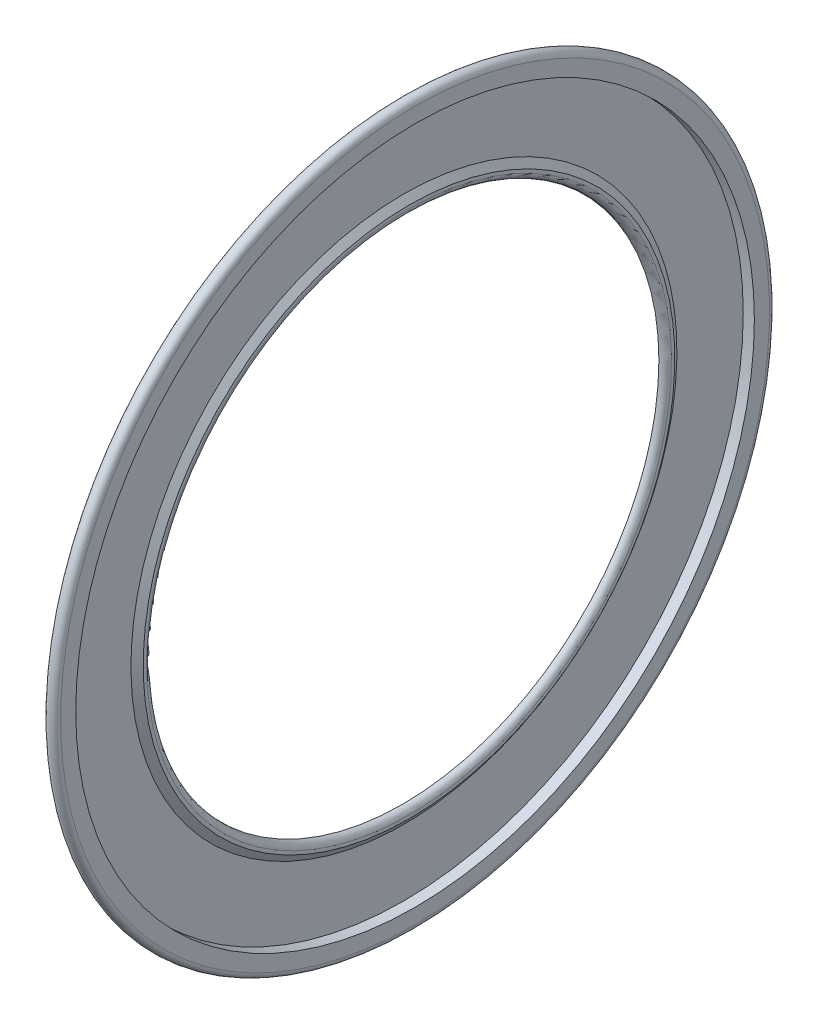
ISO-10303-21;
HEADER;
FILE_DESCRIPTION(('STEP AP214'),'2;1');
FILE_NAME('part.step','',(''),(''),'','','');
FILE_SCHEMA(('AUTOMOTIVE_DESIGN { 1 0 10303 214 1 1 1 1 }'));
ENDSEC;
DATA;
#1=APPLICATION_CONTEXT('core data for automotive mechanical design processes');
#2=APPLICATION_PROTOCOL_DEFINITION('international standard','automotive_design',2000,#1);
#3=PRODUCT_CONTEXT('',#1,'mechanical');
#4=PRODUCT('Part','Part','',(#3));
#5=PRODUCT_RELATED_PRODUCT_CATEGORY('part','',(#4));
#6=PRODUCT_DEFINITION_FORMATION('','',#4);
#7=PRODUCT_DEFINITION_CONTEXT('part definition',#1,'design');
#8=PRODUCT_DEFINITION('design','',#6,#7);
#9=PRODUCT_DEFINITION_SHAPE('','',#8);
#10=(LENGTH_UNIT() NAMED_UNIT(*) SI_UNIT(.MILLI.,.METRE.));
#11=(NAMED_UNIT(*) PLANE_ANGLE_UNIT() SI_UNIT($,.RADIAN.));
#12=(NAMED_UNIT(*) SI_UNIT($,.STERADIAN.) SOLID_ANGLE_UNIT());
#13=UNCERTAINTY_MEASURE_WITH_UNIT(LENGTH_MEASURE(1.E-05),#10,'distance_accuracy_value','');
#14=(GEOMETRIC_REPRESENTATION_CONTEXT(3) GLOBAL_UNCERTAINTY_ASSIGNED_CONTEXT((#13)) GLOBAL_UNIT_ASSIGNED_CONTEXT((#10,
#11,#12)) REPRESENTATION_CONTEXT('',''));
#15=CARTESIAN_POINT('',(0.,0.,0.));
#16=DIRECTION('',(0.,0.,1.));
#17=DIRECTION('',(1.,0.,0.));
#18=AXIS2_PLACEMENT_3D('',#15,#16,#17);
#19=CARTESIAN_POINT('',(0.245,10.600795,0.));
#20=DIRECTION('',(1.,0.,0.));
#21=DIRECTION('',(0.,1.,0.));
#22=AXIS2_PLACEMENT_3D('',#19,#20,#21);
#23=PLANE('',#22);
#24=CARTESIAN_POINT('',(0.245,0.,0.));
#25=DIRECTION('',(1.,0.,0.));
#26=DIRECTION('',(0.,1.,0.));
#27=AXIS2_PLACEMENT_3D('',#24,#25,#26);
#28=CIRCLE('',#27,11.74849);
#29=CARTESIAN_POINT('',(0.245,11.74849,0.));
#30=VERTEX_POINT('',#29);
#31=EDGE_CURVE('E11',#30,#30,#28,.T.);
#32=ORIENTED_EDGE('',*,*,#31,.T.);
#33=EDGE_LOOP('',(#32));
#34=FACE_BOUND('',#33,.T.);
#35=CARTESIAN_POINT('',(0.245,0.,0.));
#36=DIRECTION('',(1.,0.,0.));
#37=DIRECTION('',(0.,1.,0.));
#38=AXIS2_PLACEMENT_3D('',#35,#36,#37);
#39=CIRCLE('',#38,9.4531);
#40=CARTESIAN_POINT('',(0.245,9.4531,0.));
#41=VERTEX_POINT('',#40);
#42=EDGE_CURVE('E91',#41,#41,#39,.T.);
#43=ORIENTED_EDGE('',*,*,#42,.F.);
#44=EDGE_LOOP('',(#43));
#45=FACE_BOUND('',#44,.T.);
#46=ADVANCED_FACE('F16',(#34,#45),#23,.T.);
#47=CARTESIAN_POINT('',(0.4375,0.,0.));
#48=DIRECTION('',(-1.,0.,0.));
#49=DIRECTION('',(0.,1.,0.));
#50=AXIS2_PLACEMENT_3D('',#47,#48,#49);
#51=CYLINDRICAL_SURFACE('',#50,11.74849);
#52=CARTESIAN_POINT('',(0.63,0.,0.));
#53=DIRECTION('',(1.,0.,0.));
#54=DIRECTION('',(0.,1.,0.));
#55=AXIS2_PLACEMENT_3D('',#52,#53,#54);
#56=CIRCLE('',#55,11.74849);
#57=CARTESIAN_POINT('',(0.63,11.74849,0.));
#58=VERTEX_POINT('',#57);
#59=EDGE_CURVE('E26',#58,#58,#56,.T.);
#60=ORIENTED_EDGE('',*,*,#59,.T.);
#61=EDGE_LOOP('',(#60));
#62=FACE_BOUND('',#61,.T.);
#63=ORIENTED_EDGE('',*,*,#31,.F.);
#64=EDGE_LOOP('',(#63));
#65=FACE_BOUND('',#64,.T.);
#66=ADVANCED_FACE('F119',(#62,#65),#51,.F.);
#67=CARTESIAN_POINT('',(0.63,12.010245,0.));
#68=DIRECTION('',(1.,0.,0.));
#69=DIRECTION('',(0.,1.,0.));
#70=AXIS2_PLACEMENT_3D('',#67,#68,#69);
#71=PLANE('',#70);
#72=CARTESIAN_POINT('',(0.63,0.,0.));
#73=DIRECTION('',(1.,0.,0.));
#74=DIRECTION('',(0.,1.,0.));
#75=AXIS2_PLACEMENT_3D('',#72,#73,#74);
#76=CIRCLE('',#75,12.272);
#77=CARTESIAN_POINT('',(0.63,12.272,0.));
#78=VERTEX_POINT('',#77);
#79=EDGE_CURVE('E81',#78,#78,#76,.T.);
#80=ORIENTED_EDGE('',*,*,#79,.T.);
#81=EDGE_LOOP('',(#80));
#82=FACE_BOUND('',#81,.T.);
#83=ORIENTED_EDGE('',*,*,#59,.F.);
#84=EDGE_LOOP('',(#83));
#85=FACE_BOUND('',#84,.T.);
#86=ADVANCED_FACE('F82',(#82,#85),#71,.T.);
#87=CARTESIAN_POINT('',(0.42,0.,0.));
#88=DIRECTION('',(1.,0.,0.));
#89=DIRECTION('',(0.,0.,-1.));
#90=AXIS2_PLACEMENT_3D('',#87,#88,#89);
#91=TOROIDAL_SURFACE('',#90,12.272,0.21);
#92=CARTESIAN_POINT('',(0.21,0.,0.));
#93=DIRECTION('',(1.,0.,0.));
#94=DIRECTION('',(0.,1.,0.));
#95=AXIS2_PLACEMENT_3D('',#92,#93,#94);
#96=CIRCLE('',#95,12.272);
#97=CARTESIAN_POINT('',(0.21,12.272,0.));
#98=VERTEX_POINT('',#97);
#99=EDGE_CURVE('E76',#98,#98,#96,.T.);
#100=ORIENTED_EDGE('',*,*,#99,.T.);
#101=EDGE_LOOP('',(#100));
#102=FACE_BOUND('',#101,.T.);
#103=ORIENTED_EDGE('',*,*,#79,.F.);
#104=EDGE_LOOP('',(#103));
#105=FACE_BOUND('',#104,.T.);
#106=ADVANCED_FACE('F138',(#102,#105),#91,.T.);
#107=CARTESIAN_POINT('',(0.315,0.,0.));
#108=DIRECTION('',(-1.,0.,0.));
#109=DIRECTION('',(0.,1.,0.));
#110=AXIS2_PLACEMENT_3D('',#107,#108,#109);
#111=CYLINDRICAL_SURFACE('',#110,12.272);
#112=CARTESIAN_POINT('',(0.42,0.,0.));
#113=DIRECTION('',(1.,0.,0.));
#114=DIRECTION('',(0.,1.,0.));
#115=AXIS2_PLACEMENT_3D('',#112,#113,#114);
#116=CIRCLE('',#115,12.272);
#117=CARTESIAN_POINT('',(0.42,12.272,0.));
#118=VERTEX_POINT('',#117);
#119=EDGE_CURVE('E72',#118,#118,#116,.T.);
#120=ORIENTED_EDGE('',*,*,#119,.T.);
#121=EDGE_LOOP('',(#120));
#122=FACE_BOUND('',#121,.T.);
#123=ORIENTED_EDGE('',*,*,#99,.F.);
#124=EDGE_LOOP('',(#123));
#125=FACE_BOUND('',#124,.T.);
#126=ADVANCED_FACE('F18',(#122,#125),#111,.F.);
#127=CARTESIAN_POINT('',(0.42,12.19146,0.));
#128=DIRECTION('',(-1.,0.,0.));
#129=DIRECTION('',(0.,-1.,0.));
#130=AXIS2_PLACEMENT_3D('',#127,#128,#129);
#131=PLANE('',#130);
#132=CARTESIAN_POINT('',(0.42,0.,0.));
#133=DIRECTION('',(1.,0.,0.));
#134=DIRECTION('',(0.,1.,0.));
#135=AXIS2_PLACEMENT_3D('',#132,#133,#134);
#136=CIRCLE('',#135,12.11092);
#137=CARTESIAN_POINT('',(0.42,12.11092,0.));
#138=VERTEX_POINT('',#137);
#139=EDGE_CURVE('E67',#138,#138,#136,.T.);
#140=ORIENTED_EDGE('',*,*,#139,.T.);
#141=EDGE_LOOP('',(#140));
#142=FACE_BOUND('',#141,.T.);
#143=ORIENTED_EDGE('',*,*,#119,.F.);
#144=EDGE_LOOP('',(#143));
#145=FACE_BOUND('',#144,.T.);
#146=ADVANCED_FACE('F144',(#142,#145),#131,.T.);
#147=CARTESIAN_POINT('',(0.2275,0.,0.));
#148=DIRECTION('',(1.,0.,0.));
#149=DIRECTION('',(0.,1.,0.));
#150=AXIS2_PLACEMENT_3D('',#147,#148,#149);
#151=CONICAL_SURFACE('',#150,11.929705,0.755210528942879);
#152=CARTESIAN_POINT('',(0.035,0.,0.));
#153=DIRECTION('',(1.,0.,0.));
#154=DIRECTION('',(0.,1.,0.));
#155=AXIS2_PLACEMENT_3D('',#152,#153,#154);
#156=CIRCLE('',#155,11.74849);
#157=CARTESIAN_POINT('',(0.035,11.74849,0.));
#158=VERTEX_POINT('',#157);
#159=EDGE_CURVE('E20',#158,#158,#156,.T.);
#160=ORIENTED_EDGE('',*,*,#159,.T.);
#161=EDGE_LOOP('',(#160));
#162=FACE_BOUND('',#161,.T.);
#163=ORIENTED_EDGE('',*,*,#139,.F.);
#164=EDGE_LOOP('',(#163));
#165=FACE_BOUND('',#164,.T.);
#166=ADVANCED_FACE('F131',(#162,#165),#151,.T.);
#167=CARTESIAN_POINT('',(0.035,10.600795,0.));
#168=DIRECTION('',(-1.,0.,0.));
#169=DIRECTION('',(0.,-1.,0.));
#170=AXIS2_PLACEMENT_3D('',#167,#168,#169);
#171=PLANE('',#170);
#172=CARTESIAN_POINT('',(0.035,0.,0.));
#173=DIRECTION('',(1.,0.,0.));
#174=DIRECTION('',(0.,1.,0.));
#175=AXIS2_PLACEMENT_3D('',#172,#173,#174);
#176=CIRCLE('',#175,9.4531);
#177=CARTESIAN_POINT('',(0.035,9.4531,0.));
#178=VERTEX_POINT('',#177);
#179=EDGE_CURVE('E96',#178,#178,#176,.T.);
#180=ORIENTED_EDGE('',*,*,#179,.T.);
#181=EDGE_LOOP('',(#180));
#182=FACE_BOUND('',#181,.T.);
#183=ORIENTED_EDGE('',*,*,#159,.F.);
#184=EDGE_LOOP('',(#183));
#185=FACE_BOUND('',#184,.T.);
#186=ADVANCED_FACE('F127',(#182,#185),#171,.T.);
#187=CARTESIAN_POINT('',(0.11375,0.,0.));
#188=DIRECTION('',(-1.,0.,0.));
#189=DIRECTION('',(0.,1.,0.));
#190=AXIS2_PLACEMENT_3D('',#187,#188,#189);
#191=CONICAL_SURFACE('',#190,9.34063334446906,0.959931088596881);
#192=CARTESIAN_POINT('',(0.1925,0.,0.));
#193=DIRECTION('',(1.,0.,0.));
#194=DIRECTION('',(0.,1.,0.));
#195=AXIS2_PLACEMENT_3D('',#192,#193,#194);
#196=CIRCLE('',#195,9.22816668893812);
#197=CARTESIAN_POINT('',(0.1925,9.22816668893812,0.));
#198=VERTEX_POINT('',#197);
#199=EDGE_CURVE('E95',#198,#198,#196,.T.);
#200=ORIENTED_EDGE('',*,*,#199,.T.);
#201=EDGE_LOOP('',(#200));
#202=FACE_BOUND('',#201,.T.);
#203=ORIENTED_EDGE('',*,*,#179,.F.);
#204=EDGE_LOOP('',(#203));
#205=FACE_BOUND('',#204,.T.);
#206=ADVANCED_FACE('F130',(#202,#205),#191,.F.);
#207=CARTESIAN_POINT('',(0.1925,9.05389856296692,0.));
#208=DIRECTION('',(-1.,0.,0.));
#209=DIRECTION('',(0.,-1.,0.));
#210=AXIS2_PLACEMENT_3D('',#207,#208,#209);
#211=PLANE('',#210);
#212=CARTESIAN_POINT('',(0.1925,0.,0.));
#213=DIRECTION('',(1.,0.,0.));
#214=DIRECTION('',(0.,1.,0.));
#215=AXIS2_PLACEMENT_3D('',#212,#213,#214);
#216=CIRCLE('',#215,8.87963043699572);
#217=CARTESIAN_POINT('',(0.1925,8.87963043699572,0.));
#218=VERTEX_POINT('',#217);
#219=EDGE_CURVE('E55',#218,#218,#216,.T.);
#220=ORIENTED_EDGE('',*,*,#219,.T.);
#221=EDGE_LOOP('',(#220));
#222=FACE_BOUND('',#221,.T.);
#223=ORIENTED_EDGE('',*,*,#199,.F.);
#224=EDGE_LOOP('',(#223));
#225=FACE_BOUND('',#224,.T.);
#226=ADVANCED_FACE('F135',(#222,#225),#211,.T.);
#227=CARTESIAN_POINT('',(0.21,0.,0.));
#228=DIRECTION('',(1.,0.,0.));
#229=DIRECTION('',(0.,0.,-1.));
#230=AXIS2_PLACEMENT_3D('',#227,#228,#229);
#231=TOROIDAL_SURFACE('',#230,9.0889,0.21);
#232=CARTESIAN_POINT('',(0.42,0.,0.));
#233=DIRECTION('',(1.,0.,0.));
#234=DIRECTION('',(0.,1.,0.));
#235=AXIS2_PLACEMENT_3D('',#232,#233,#234);
#236=CIRCLE('',#235,9.0889);
#237=CARTESIAN_POINT('',(0.42,9.0889,0.));
#238=VERTEX_POINT('',#237);
#239=EDGE_CURVE('E62',#238,#238,#236,.T.);
#240=ORIENTED_EDGE('',*,*,#239,.T.);
#241=EDGE_LOOP('',(#240));
#242=FACE_BOUND('',#241,.T.);
#243=ORIENTED_EDGE('',*,*,#219,.F.);
#244=EDGE_LOOP('',(#243));
#245=FACE_BOUND('',#244,.T.);
#246=ADVANCED_FACE('F114',(#242,#245),#231,.T.);
#247=CARTESIAN_POINT('',(0.42,9.14603704941007,0.));
#248=DIRECTION('',(1.,0.,0.));
#249=DIRECTION('',(0.,1.,0.));
#250=AXIS2_PLACEMENT_3D('',#247,#248,#249);
#251=PLANE('',#250);
#252=CARTESIAN_POINT('',(0.42,0.,0.));
#253=DIRECTION('',(1.,0.,0.));
#254=DIRECTION('',(0.,1.,0.));
#255=AXIS2_PLACEMENT_3D('',#252,#253,#254);
#256=CIRCLE('',#255,9.20317409882013);
#257=CARTESIAN_POINT('',(0.42,9.20317409882013,0.));
#258=VERTEX_POINT('',#257);
#259=EDGE_CURVE('E92',#258,#258,#256,.T.);
#260=ORIENTED_EDGE('',*,*,#259,.T.);
#261=EDGE_LOOP('',(#260));
#262=FACE_BOUND('',#261,.T.);
#263=ORIENTED_EDGE('',*,*,#239,.F.);
#264=EDGE_LOOP('',(#263));
#265=FACE_BOUND('',#264,.T.);
#266=ADVANCED_FACE('F103',(#262,#265),#251,.T.);
#267=CARTESIAN_POINT('',(0.3325,0.,0.));
#268=DIRECTION('',(-1.,0.,0.));
#269=DIRECTION('',(0.,1.,0.));
#270=AXIS2_PLACEMENT_3D('',#267,#268,#269);
#271=CONICAL_SURFACE('',#270,9.32813704941006,0.959931088596879);
#272=ORIENTED_EDGE('',*,*,#42,.T.);
#273=EDGE_LOOP('',(#272));
#274=FACE_BOUND('',#273,.T.);
#275=ORIENTED_EDGE('',*,*,#259,.F.);
#276=EDGE_LOOP('',(#275));
#277=FACE_BOUND('',#276,.T.);
#278=ADVANCED_FACE('F106',(#274,#277),#271,.T.);
#279=CLOSED_SHELL('',(#46,#66,#86,#106,#126,#146,#166,#186,#206,#226,#246,#266,#278));
#280=MANIFOLD_SOLID_BREP('B1',#279);
#281=ADVANCED_BREP_SHAPE_REPRESENTATION('',(#18,#280),#14);
#282=SHAPE_DEFINITION_REPRESENTATION(#9,#281);
ENDSEC;
END-ISO-10303-21;
